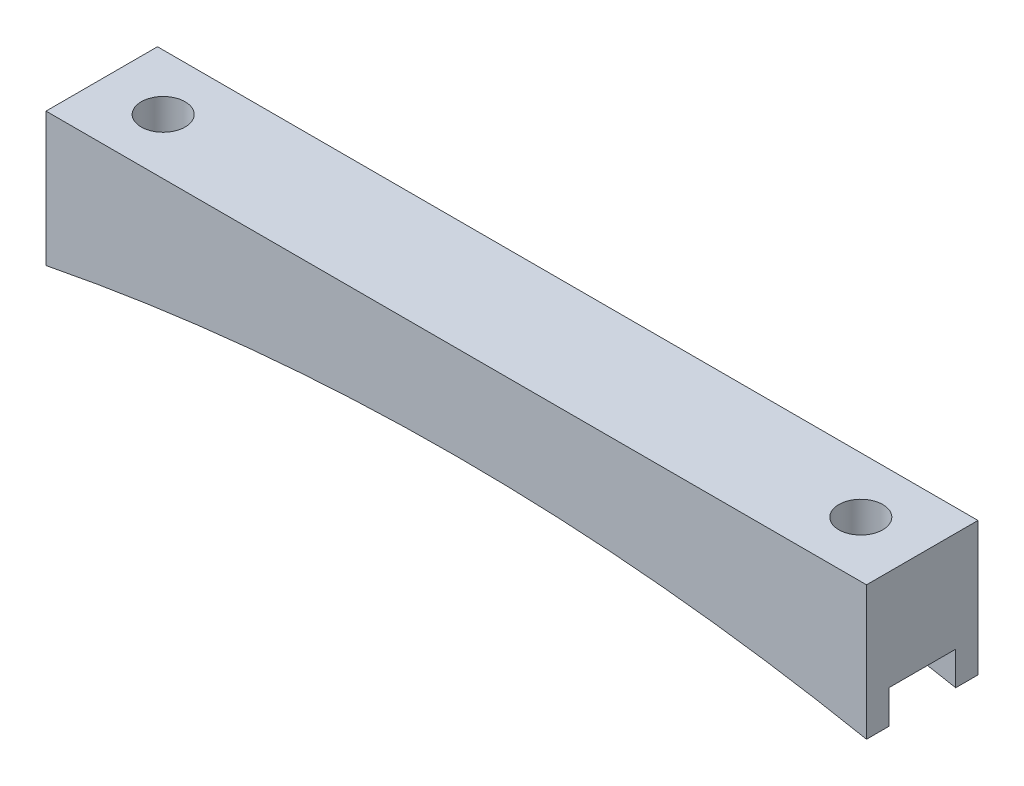
ISO-10303-21;
HEADER;
FILE_DESCRIPTION(('STEP AP214'),'2;1');
FILE_NAME('part.step','',(''),(''),'','','');
FILE_SCHEMA(('AUTOMOTIVE_DESIGN { 1 0 10303 214 1 1 1 1 }'));
ENDSEC;
DATA;
#1=APPLICATION_CONTEXT('core data for automotive mechanical design processes');
#2=APPLICATION_PROTOCOL_DEFINITION('international standard','automotive_design',2000,#1);
#3=PRODUCT_CONTEXT('',#1,'mechanical');
#4=PRODUCT('Part','Part','',(#3));
#5=PRODUCT_RELATED_PRODUCT_CATEGORY('part','',(#4));
#6=PRODUCT_DEFINITION_FORMATION('','',#4);
#7=PRODUCT_DEFINITION_CONTEXT('part definition',#1,'design');
#8=PRODUCT_DEFINITION('design','',#6,#7);
#9=PRODUCT_DEFINITION_SHAPE('','',#8);
#10=(LENGTH_UNIT() NAMED_UNIT(*) SI_UNIT(.MILLI.,.METRE.));
#11=(NAMED_UNIT(*) PLANE_ANGLE_UNIT() SI_UNIT($,.RADIAN.));
#12=(NAMED_UNIT(*) SI_UNIT($,.STERADIAN.) SOLID_ANGLE_UNIT());
#13=UNCERTAINTY_MEASURE_WITH_UNIT(LENGTH_MEASURE(1.E-05),#10,'distance_accuracy_value','');
#14=(GEOMETRIC_REPRESENTATION_CONTEXT(3) GLOBAL_UNCERTAINTY_ASSIGNED_CONTEXT((#13)) GLOBAL_UNIT_ASSIGNED_CONTEXT((#10,
#11,#12)) REPRESENTATION_CONTEXT('',''));
#15=CARTESIAN_POINT('',(0.,0.,0.));
#16=DIRECTION('',(0.,0.,1.));
#17=DIRECTION('',(1.,0.,0.));
#18=AXIS2_PLACEMENT_3D('',#15,#16,#17);
#19=CARTESIAN_POINT('',(46.735,0.,12.7));
#20=DIRECTION('',(-1.,0.,0.));
#21=DIRECTION('',(0.,0.,1.));
#22=AXIS2_PLACEMENT_3D('',#19,#20,#21);
#23=PLANE('',#22);
#24=DIRECTION('',(0.,0.,-1.));
#25=VECTOR('',#24,1.);
#26=CARTESIAN_POINT('',(46.735,-15.24,12.7));
#27=LINE('',#26,#25);
#28=CARTESIAN_POINT('',(46.735,-15.24,12.7));
#29=VERTEX_POINT('',#28);
#30=CARTESIAN_POINT('',(46.735,-15.24,10.16));
#31=VERTEX_POINT('',#30);
#32=EDGE_CURVE('E156',#29,#31,#27,.T.);
#33=ORIENTED_EDGE('',*,*,#32,.T.);
#34=DIRECTION('',(0.,-1.,0.));
#35=VECTOR('',#34,1.);
#36=CARTESIAN_POINT('',(46.735,-15.24,10.16));
#37=LINE('',#36,#35);
#38=CARTESIAN_POINT('',(46.735,-11.43,10.16));
#39=VERTEX_POINT('',#38);
#40=EDGE_CURVE('E185',#39,#31,#37,.T.);
#41=ORIENTED_EDGE('',*,*,#40,.F.);
#42=DIRECTION('',(0.,0.,1.));
#43=VECTOR('',#42,1.);
#44=CARTESIAN_POINT('',(46.735,-11.43,10.16));
#45=LINE('',#44,#43);
#46=CARTESIAN_POINT('',(46.735,-11.43,2.54));
#47=VERTEX_POINT('',#46);
#48=EDGE_CURVE('E141',#47,#39,#45,.T.);
#49=ORIENTED_EDGE('',*,*,#48,.F.);
#50=DIRECTION('',(0.,1.,0.));
#51=VECTOR('',#50,1.);
#52=CARTESIAN_POINT('',(46.735,-15.24,2.54));
#53=LINE('',#52,#51);
#54=CARTESIAN_POINT('',(46.735,-15.24,2.54));
#55=VERTEX_POINT('',#54);
#56=EDGE_CURVE('E177',#55,#47,#53,.T.);
#57=ORIENTED_EDGE('',*,*,#56,.F.);
#58=CARTESIAN_POINT('',(46.735,-15.24,0.));
#59=VERTEX_POINT('',#58);
#60=EDGE_CURVE('E174',#55,#59,#27,.T.);
#61=ORIENTED_EDGE('',*,*,#60,.T.);
#62=DIRECTION('',(0.,1.,0.));
#63=VECTOR('',#62,1.);
#64=CARTESIAN_POINT('',(46.735,0.,0.));
#65=LINE('',#64,#63);
#66=CARTESIAN_POINT('',(46.735,0.,0.));
#67=VERTEX_POINT('',#66);
#68=EDGE_CURVE('E213',#59,#67,#65,.T.);
#69=ORIENTED_EDGE('',*,*,#68,.T.);
#70=DIRECTION('',(0.,0.,-1.));
#71=VECTOR('',#70,1.);
#72=CARTESIAN_POINT('',(46.735,0.,12.7));
#73=LINE('',#72,#71);
#74=CARTESIAN_POINT('',(46.735,0.,12.7));
#75=VERTEX_POINT('',#74);
#76=EDGE_CURVE('E154',#75,#67,#73,.T.);
#77=ORIENTED_EDGE('',*,*,#76,.F.);
#78=DIRECTION('',(0.,1.,0.));
#79=VECTOR('',#78,1.);
#80=CARTESIAN_POINT('',(46.735,0.,12.7));
#81=LINE('',#80,#79);
#82=EDGE_CURVE('E217',#29,#75,#81,.T.);
#83=ORIENTED_EDGE('',*,*,#82,.F.);
#84=EDGE_LOOP('',(#33,#41,#49,#57,#61,#69,#77,#83));
#85=FACE_BOUND('',#84,.T.);
#86=ADVANCED_FACE('F43',(#85),#23,.F.);
#87=CARTESIAN_POINT('',(-46.735,0.,12.7));
#88=DIRECTION('',(0.,-1.,0.));
#89=DIRECTION('',(1.,0.,0.));
#90=AXIS2_PLACEMENT_3D('',#87,#88,#89);
#91=PLANE('',#90);
#92=CARTESIAN_POINT('',(-39.735,0.,6.35));
#93=DIRECTION('',(0.,1.,0.));
#94=DIRECTION('',(-1.,0.,0.));
#95=AXIS2_PLACEMENT_3D('',#92,#93,#94);
#96=CIRCLE('',#95,2.49999999999999);
#97=CARTESIAN_POINT('',(-42.235,0.,6.35));
#98=VERTEX_POINT('',#97);
#99=EDGE_CURVE('E209',#98,#98,#96,.T.);
#100=ORIENTED_EDGE('',*,*,#99,.F.);
#101=EDGE_LOOP('',(#100));
#102=FACE_BOUND('',#101,.T.);
#103=CARTESIAN_POINT('',(39.735,0.,6.35));
#104=DIRECTION('',(0.,1.,0.));
#105=DIRECTION('',(-1.,0.,0.));
#106=AXIS2_PLACEMENT_3D('',#103,#104,#105);
#107=CIRCLE('',#106,2.5);
#108=CARTESIAN_POINT('',(37.235,0.,6.35));
#109=VERTEX_POINT('',#108);
#110=EDGE_CURVE('E208',#109,#109,#107,.T.);
#111=ORIENTED_EDGE('',*,*,#110,.F.);
#112=EDGE_LOOP('',(#111));
#113=FACE_BOUND('',#112,.T.);
#114=DIRECTION('',(-1.,0.,0.));
#115=VECTOR('',#114,1.);
#116=CARTESIAN_POINT('',(-46.735,0.,0.));
#117=LINE('',#116,#115);
#118=CARTESIAN_POINT('',(-46.735,0.,0.));
#119=VERTEX_POINT('',#118);
#120=EDGE_CURVE('E232',#67,#119,#117,.T.);
#121=ORIENTED_EDGE('',*,*,#120,.T.);
#122=DIRECTION('',(0.,0.,-1.));
#123=VECTOR('',#122,1.);
#124=CARTESIAN_POINT('',(-46.735,0.,12.7));
#125=LINE('',#124,#123);
#126=CARTESIAN_POINT('',(-46.735,0.,12.7));
#127=VERTEX_POINT('',#126);
#128=EDGE_CURVE('E148',#127,#119,#125,.T.);
#129=ORIENTED_EDGE('',*,*,#128,.F.);
#130=DIRECTION('',(-1.,0.,0.));
#131=VECTOR('',#130,1.);
#132=CARTESIAN_POINT('',(-46.735,0.,12.7));
#133=LINE('',#132,#131);
#134=EDGE_CURVE('E221',#75,#127,#133,.T.);
#135=ORIENTED_EDGE('',*,*,#134,.F.);
#136=ORIENTED_EDGE('',*,*,#76,.T.);
#137=EDGE_LOOP('',(#121,#129,#135,#136));
#138=FACE_BOUND('',#137,.T.);
#139=ADVANCED_FACE('F247',(#102,#113,#138),#91,.F.);
#140=CARTESIAN_POINT('',(-46.735,0.,12.7));
#141=DIRECTION('',(1.,0.,0.));
#142=DIRECTION('',(0.,0.,-1.));
#143=AXIS2_PLACEMENT_3D('',#140,#141,#142);
#144=PLANE('',#143);
#145=DIRECTION('',(0.,0.,1.));
#146=VECTOR('',#145,1.);
#147=CARTESIAN_POINT('',(-46.735,-11.43,10.16));
#148=LINE('',#147,#146);
#149=CARTESIAN_POINT('',(-46.735,-11.43,2.54));
#150=VERTEX_POINT('',#149);
#151=CARTESIAN_POINT('',(-46.735,-11.43,10.16));
#152=VERTEX_POINT('',#151);
#153=EDGE_CURVE('E139',#150,#152,#148,.T.);
#154=ORIENTED_EDGE('',*,*,#153,.T.);
#155=DIRECTION('',(0.,-1.,0.));
#156=VECTOR('',#155,1.);
#157=CARTESIAN_POINT('',(-46.735,-15.24,10.16));
#158=LINE('',#157,#156);
#159=CARTESIAN_POINT('',(-46.735,-15.24,10.16));
#160=VERTEX_POINT('',#159);
#161=EDGE_CURVE('E124',#152,#160,#158,.T.);
#162=ORIENTED_EDGE('',*,*,#161,.T.);
#163=DIRECTION('',(0.,0.,-1.));
#164=VECTOR('',#163,1.);
#165=CARTESIAN_POINT('',(-46.735,-15.24,12.7));
#166=LINE('',#165,#164);
#167=CARTESIAN_POINT('',(-46.735,-15.24,12.7));
#168=VERTEX_POINT('',#167);
#169=EDGE_CURVE('E136',#168,#160,#166,.T.);
#170=ORIENTED_EDGE('',*,*,#169,.F.);
#171=DIRECTION('',(0.,-1.,0.));
#172=VECTOR('',#171,1.);
#173=CARTESIAN_POINT('',(-46.735,0.,12.7));
#174=LINE('',#173,#172);
#175=EDGE_CURVE('E225',#127,#168,#174,.T.);
#176=ORIENTED_EDGE('',*,*,#175,.F.);
#177=ORIENTED_EDGE('',*,*,#128,.T.);
#178=DIRECTION('',(0.,-1.,0.));
#179=VECTOR('',#178,1.);
#180=CARTESIAN_POINT('',(-46.735,0.,0.));
#181=LINE('',#180,#179);
#182=CARTESIAN_POINT('',(-46.735,-15.24,0.));
#183=VERTEX_POINT('',#182);
#184=EDGE_CURVE('E235',#119,#183,#181,.T.);
#185=ORIENTED_EDGE('',*,*,#184,.T.);
#186=CARTESIAN_POINT('',(-46.735,-15.24,2.54));
#187=VERTEX_POINT('',#186);
#188=EDGE_CURVE('E149',#187,#183,#166,.T.);
#189=ORIENTED_EDGE('',*,*,#188,.F.);
#190=DIRECTION('',(0.,1.,0.));
#191=VECTOR('',#190,1.);
#192=CARTESIAN_POINT('',(-46.735,-15.24,2.54));
#193=LINE('',#192,#191);
#194=EDGE_CURVE('E67',#187,#150,#193,.T.);
#195=ORIENTED_EDGE('',*,*,#194,.T.);
#196=EDGE_LOOP('',(#154,#162,#170,#176,#177,#185,#189,#195));
#197=FACE_BOUND('',#196,.T.);
#198=ADVANCED_FACE('F134',(#197),#144,.F.);
#199=CARTESIAN_POINT('',(0.,-251.970922726626,12.7));
#200=DIRECTION('',(0.,0.,-1.));
#201=DIRECTION('',(-1.,0.,0.));
#202=AXIS2_PLACEMENT_3D('',#199,#200,#201);
#203=CYLINDRICAL_SURFACE('',#202,241.3);
#204=DIRECTION('',(0.,0.,-1.));
#205=VECTOR('',#204,1.);
#206=CARTESIAN_POINT('',(19.1247089866252,-11.43,12.7));
#207=LINE('',#206,#205);
#208=CARTESIAN_POINT('',(19.1247089866252,-11.43,2.54));
#209=VERTEX_POINT('',#208);
#210=CARTESIAN_POINT('',(19.1247089866252,-11.43,10.16));
#211=VERTEX_POINT('',#210);
#212=EDGE_CURVE('E172',#209,#211,#207,.F.);
#213=ORIENTED_EDGE('',*,*,#212,.T.);
#214=CARTESIAN_POINT('',(0.,-251.970922726626,10.16));
#215=DIRECTION('',(0.,0.,1.));
#216=DIRECTION('',(1.,0.,0.));
#217=AXIS2_PLACEMENT_3D('',#214,#215,#216);
#218=CIRCLE('',#217,241.3);
#219=EDGE_CURVE('E11',#211,#31,#218,.F.);
#220=ORIENTED_EDGE('',*,*,#219,.T.);
#221=ORIENTED_EDGE('',*,*,#32,.F.);
#222=CARTESIAN_POINT('',(0.,-251.970922726626,12.7));
#223=DIRECTION('',(0.,0.,-1.));
#224=DIRECTION('',(-1.,0.,0.));
#225=AXIS2_PLACEMENT_3D('',#222,#223,#224);
#226=CIRCLE('',#225,241.3);
#227=EDGE_CURVE('E146',#168,#29,#226,.T.);
#228=ORIENTED_EDGE('',*,*,#227,.F.);
#229=ORIENTED_EDGE('',*,*,#169,.T.);
#230=CARTESIAN_POINT('',(-19.1247089866252,-11.43,10.16));
#231=VERTEX_POINT('',#230);
#232=EDGE_CURVE('E46',#160,#231,#218,.F.);
#233=ORIENTED_EDGE('',*,*,#232,.T.);
#234=DIRECTION('',(0.,0.,-1.));
#235=VECTOR('',#234,1.);
#236=CARTESIAN_POINT('',(-19.1247089866252,-11.43,12.7));
#237=LINE('',#236,#235);
#238=CARTESIAN_POINT('',(-19.1247089866252,-11.43,2.54));
#239=VERTEX_POINT('',#238);
#240=EDGE_CURVE('E203',#231,#239,#237,.T.);
#241=ORIENTED_EDGE('',*,*,#240,.T.);
#242=CARTESIAN_POINT('',(0.,-251.970922726626,2.54));
#243=DIRECTION('',(0.,0.,-1.));
#244=DIRECTION('',(-1.,0.,0.));
#245=AXIS2_PLACEMENT_3D('',#242,#243,#244);
#246=CIRCLE('',#245,241.3);
#247=EDGE_CURVE('E131',#239,#187,#246,.F.);
#248=ORIENTED_EDGE('',*,*,#247,.T.);
#249=ORIENTED_EDGE('',*,*,#188,.T.);
#250=CARTESIAN_POINT('',(0.,-251.970922726626,0.));
#251=DIRECTION('',(0.,0.,-1.));
#252=DIRECTION('',(-1.,0.,0.));
#253=AXIS2_PLACEMENT_3D('',#250,#251,#252);
#254=CIRCLE('',#253,241.3);
#255=EDGE_CURVE('E222',#183,#59,#254,.T.);
#256=ORIENTED_EDGE('',*,*,#255,.T.);
#257=ORIENTED_EDGE('',*,*,#60,.F.);
#258=EDGE_CURVE('E52',#55,#209,#246,.F.);
#259=ORIENTED_EDGE('',*,*,#258,.T.);
#260=EDGE_LOOP('',(#213,#220,#221,#228,#229,#233,#241,#248,#249,#256,#257,#259));
#261=FACE_BOUND('',#260,.T.);
#262=ADVANCED_FACE('F144',(#261),#203,.F.);
#263=CARTESIAN_POINT('',(0.,-251.970922726626,12.7));
#264=DIRECTION('',(0.,0.,-1.));
#265=DIRECTION('',(-1.,0.,0.));
#266=AXIS2_PLACEMENT_3D('',#263,#264,#265);
#267=PLANE('',#266);
#268=ORIENTED_EDGE('',*,*,#82,.T.);
#269=ORIENTED_EDGE('',*,*,#134,.T.);
#270=ORIENTED_EDGE('',*,*,#175,.T.);
#271=ORIENTED_EDGE('',*,*,#227,.T.);
#272=EDGE_LOOP('',(#268,#269,#270,#271));
#273=FACE_BOUND('',#272,.T.);
#274=ADVANCED_FACE('F250',(#273),#267,.F.);
#275=CARTESIAN_POINT('',(0.,-251.970922726626,0.));
#276=DIRECTION('',(0.,0.,-1.));
#277=DIRECTION('',(-1.,0.,0.));
#278=AXIS2_PLACEMENT_3D('',#275,#276,#277);
#279=PLANE('',#278);
#280=ORIENTED_EDGE('',*,*,#68,.F.);
#281=ORIENTED_EDGE('',*,*,#255,.F.);
#282=ORIENTED_EDGE('',*,*,#184,.F.);
#283=ORIENTED_EDGE('',*,*,#120,.F.);
#284=EDGE_LOOP('',(#280,#281,#282,#283));
#285=FACE_BOUND('',#284,.T.);
#286=ADVANCED_FACE('F243',(#285),#279,.T.);
#287=CARTESIAN_POINT('',(39.735,-15.24,6.35));
#288=DIRECTION('',(0.,1.,0.));
#289=DIRECTION('',(-1.,0.,0.));
#290=AXIS2_PLACEMENT_3D('',#287,#288,#289);
#291=CYLINDRICAL_SURFACE('',#290,2.5);
#292=CARTESIAN_POINT('',(39.735,-11.43,6.35));
#293=DIRECTION('',(0.,1.,0.));
#294=DIRECTION('',(0.,0.,1.));
#295=AXIS2_PLACEMENT_3D('',#292,#293,#294);
#296=CIRCLE('',#295,2.5);
#297=CARTESIAN_POINT('',(39.735,-11.43,8.85));
#298=VERTEX_POINT('',#297);
#299=EDGE_CURVE('E166',#298,#298,#296,.F.);
#300=ORIENTED_EDGE('',*,*,#299,.T.);
#301=EDGE_LOOP('',(#300));
#302=FACE_BOUND('',#301,.T.);
#303=ORIENTED_EDGE('',*,*,#110,.T.);
#304=EDGE_LOOP('',(#303));
#305=FACE_BOUND('',#304,.T.);
#306=ADVANCED_FACE('F292',(#302,#305),#291,.F.);
#307=CARTESIAN_POINT('',(-39.735,-15.24,6.35));
#308=DIRECTION('',(0.,1.,0.));
#309=DIRECTION('',(-1.,0.,0.));
#310=AXIS2_PLACEMENT_3D('',#307,#308,#309);
#311=CYLINDRICAL_SURFACE('',#310,2.49999999999999);
#312=CARTESIAN_POINT('',(-39.735,-11.43,6.35));
#313=DIRECTION('',(0.,1.,0.));
#314=DIRECTION('',(0.,0.,1.));
#315=AXIS2_PLACEMENT_3D('',#312,#313,#314);
#316=CIRCLE('',#315,2.49999999999999);
#317=CARTESIAN_POINT('',(-39.735,-11.43,8.84999999999999));
#318=VERTEX_POINT('',#317);
#319=EDGE_CURVE('E163',#318,#318,#316,.F.);
#320=ORIENTED_EDGE('',*,*,#319,.T.);
#321=EDGE_LOOP('',(#320));
#322=FACE_BOUND('',#321,.T.);
#323=ORIENTED_EDGE('',*,*,#99,.T.);
#324=EDGE_LOOP('',(#323));
#325=FACE_BOUND('',#324,.T.);
#326=ADVANCED_FACE('F274',(#322,#325),#311,.F.);
#327=CARTESIAN_POINT('',(-46.735,-11.43,10.16));
#328=DIRECTION('',(0.,1.,0.));
#329=DIRECTION('',(0.,0.,1.));
#330=AXIS2_PLACEMENT_3D('',#327,#328,#329);
#331=PLANE('',#330);
#332=ORIENTED_EDGE('',*,*,#319,.F.);
#333=EDGE_LOOP('',(#332));
#334=FACE_BOUND('',#333,.T.);
#335=DIRECTION('',(1.,0.,0.));
#336=VECTOR('',#335,1.);
#337=CARTESIAN_POINT('',(-46.735,-11.43,10.16));
#338=LINE('',#337,#336);
#339=EDGE_CURVE('E126',#152,#231,#338,.T.);
#340=ORIENTED_EDGE('',*,*,#339,.F.);
#341=ORIENTED_EDGE('',*,*,#153,.F.);
#342=DIRECTION('',(1.,0.,0.));
#343=VECTOR('',#342,1.);
#344=CARTESIAN_POINT('',(-46.735,-11.43,2.54));
#345=LINE('',#344,#343);
#346=EDGE_CURVE('E196',#150,#239,#345,.T.);
#347=ORIENTED_EDGE('',*,*,#346,.T.);
#348=ORIENTED_EDGE('',*,*,#240,.F.);
#349=EDGE_LOOP('',(#340,#341,#347,#348));
#350=FACE_BOUND('',#349,.T.);
#351=ADVANCED_FACE('F266',(#334,#350),#331,.F.);
#352=CARTESIAN_POINT('',(-46.735,-15.24,2.54));
#353=DIRECTION('',(0.,0.,-1.));
#354=DIRECTION('',(-1.,0.,0.));
#355=AXIS2_PLACEMENT_3D('',#352,#353,#354);
#356=PLANE('',#355);
#357=ORIENTED_EDGE('',*,*,#346,.F.);
#358=ORIENTED_EDGE('',*,*,#194,.F.);
#359=ORIENTED_EDGE('',*,*,#247,.F.);
#360=EDGE_LOOP('',(#357,#358,#359));
#361=FACE_BOUND('',#360,.T.);
#362=ADVANCED_FACE('F271',(#361),#356,.F.);
#363=CARTESIAN_POINT('',(-46.735,-15.24,10.16));
#364=DIRECTION('',(0.,0.,1.));
#365=DIRECTION('',(1.,0.,0.));
#366=AXIS2_PLACEMENT_3D('',#363,#364,#365);
#367=PLANE('',#366);
#368=ORIENTED_EDGE('',*,*,#161,.F.);
#369=ORIENTED_EDGE('',*,*,#339,.T.);
#370=ORIENTED_EDGE('',*,*,#232,.F.);
#371=EDGE_LOOP('',(#368,#369,#370));
#372=FACE_BOUND('',#371,.T.);
#373=ADVANCED_FACE('F123',(#372),#367,.F.);
#374=EDGE_CURVE('E195',#211,#39,#338,.T.);
#375=ORIENTED_EDGE('',*,*,#374,.T.);
#376=ORIENTED_EDGE('',*,*,#40,.T.);
#377=ORIENTED_EDGE('',*,*,#219,.F.);
#378=EDGE_LOOP('',(#375,#376,#377));
#379=FACE_BOUND('',#378,.T.);
#380=ADVANCED_FACE('F254',(#379),#367,.F.);
#381=ORIENTED_EDGE('',*,*,#56,.T.);
#382=EDGE_CURVE('E59',#209,#47,#345,.T.);
#383=ORIENTED_EDGE('',*,*,#382,.F.);
#384=ORIENTED_EDGE('',*,*,#258,.F.);
#385=EDGE_LOOP('',(#381,#383,#384));
#386=FACE_BOUND('',#385,.T.);
#387=ADVANCED_FACE('F176',(#386),#356,.F.);
#388=ORIENTED_EDGE('',*,*,#299,.F.);
#389=EDGE_LOOP('',(#388));
#390=FACE_BOUND('',#389,.T.);
#391=ORIENTED_EDGE('',*,*,#382,.T.);
#392=ORIENTED_EDGE('',*,*,#48,.T.);
#393=ORIENTED_EDGE('',*,*,#374,.F.);
#394=ORIENTED_EDGE('',*,*,#212,.F.);
#395=EDGE_LOOP('',(#391,#392,#393,#394));
#396=FACE_BOUND('',#395,.T.);
#397=ADVANCED_FACE('F258',(#390,#396),#331,.F.);
#398=CLOSED_SHELL('',(#86,#139,#198,#262,#274,#286,#306,#326,#351,#362,#373,#380,#387,#397));
#399=MANIFOLD_SOLID_BREP('B2',#398);
#400=ADVANCED_BREP_SHAPE_REPRESENTATION('',(#18,#399),#14);
#401=SHAPE_DEFINITION_REPRESENTATION(#9,#400);
ENDSEC;
END-ISO-10303-21;
